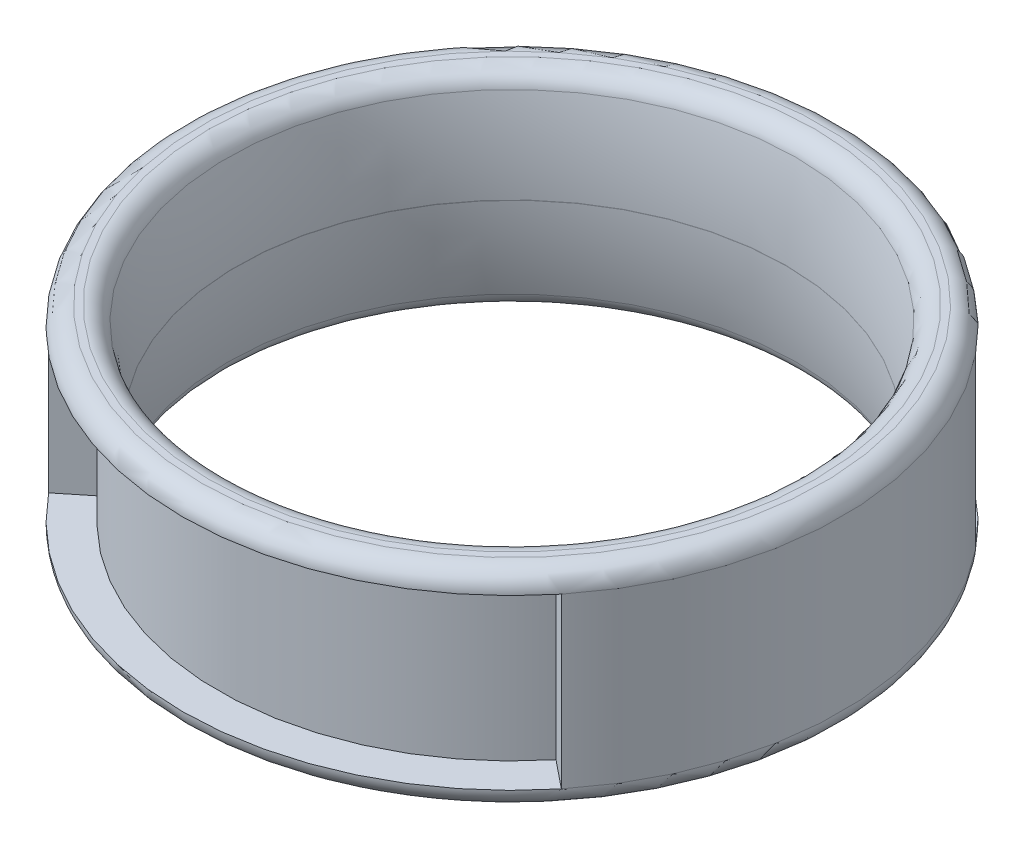
ISO-10303-21;
HEADER;
FILE_DESCRIPTION(('STEP AP214'),'2;1');
FILE_NAME('part.step','',(''),(''),'','','');
FILE_SCHEMA(('AUTOMOTIVE_DESIGN { 1 0 10303 214 1 1 1 1 }'));
ENDSEC;
DATA;
#1=APPLICATION_CONTEXT('core data for automotive mechanical design processes');
#2=APPLICATION_PROTOCOL_DEFINITION('international standard','automotive_design',2000,#1);
#3=PRODUCT_CONTEXT('',#1,'mechanical');
#4=PRODUCT('Part','Part','',(#3));
#5=PRODUCT_RELATED_PRODUCT_CATEGORY('part','',(#4));
#6=PRODUCT_DEFINITION_FORMATION('','',#4);
#7=PRODUCT_DEFINITION_CONTEXT('part definition',#1,'design');
#8=PRODUCT_DEFINITION('design','',#6,#7);
#9=PRODUCT_DEFINITION_SHAPE('','',#8);
#10=(LENGTH_UNIT() NAMED_UNIT(*) SI_UNIT(.MILLI.,.METRE.));
#11=(NAMED_UNIT(*) PLANE_ANGLE_UNIT() SI_UNIT($,.RADIAN.));
#12=(NAMED_UNIT(*) SI_UNIT($,.STERADIAN.) SOLID_ANGLE_UNIT());
#13=UNCERTAINTY_MEASURE_WITH_UNIT(LENGTH_MEASURE(1.E-05),#10,'distance_accuracy_value','');
#14=(GEOMETRIC_REPRESENTATION_CONTEXT(3) GLOBAL_UNCERTAINTY_ASSIGNED_CONTEXT((#13)) GLOBAL_UNIT_ASSIGNED_CONTEXT((#10,
#11,#12)) REPRESENTATION_CONTEXT('',''));
#15=CARTESIAN_POINT('',(0.,0.,0.));
#16=DIRECTION('',(0.,0.,1.));
#17=DIRECTION('',(1.,0.,0.));
#18=AXIS2_PLACEMENT_3D('',#15,#16,#17);
#19=CARTESIAN_POINT('',(0.,-3.75,0.));
#20=DIRECTION('',(0.,1.,0.));
#21=DIRECTION('',(0.,0.,1.));
#22=AXIS2_PLACEMENT_3D('',#19,#20,#21);
#23=CYLINDRICAL_SURFACE('',#22,11.92);
#24=CARTESIAN_POINT('',(0.,-3.05,0.));
#25=DIRECTION('',(0.,1.,0.));
#26=DIRECTION('',(0.,0.,1.));
#27=AXIS2_PLACEMENT_3D('',#24,#25,#26);
#28=CIRCLE('',#27,11.92);
#29=CARTESIAN_POINT('',(-9.27404489584876,-3.05,-7.48855735571155));
#30=VERTEX_POINT('',#29);
#31=CARTESIAN_POINT('',(-9.27404489584876,-3.05,7.48855735571155));
#32=VERTEX_POINT('',#31);
#33=EDGE_CURVE('E167',#30,#32,#28,.T.);
#34=ORIENTED_EDGE('',*,*,#33,.T.);
#35=DIRECTION('',(0.,1.,0.));
#36=VECTOR('',#35,1.);
#37=CARTESIAN_POINT('',(-9.27404489584876,3.05,7.48855735571155));
#38=LINE('',#37,#36);
#39=CARTESIAN_POINT('',(-9.27404489584876,3.05,7.48855735571155));
#40=VERTEX_POINT('',#39);
#41=EDGE_CURVE('E234',#32,#40,#38,.T.);
#42=ORIENTED_EDGE('',*,*,#41,.T.);
#43=CARTESIAN_POINT('',(0.,3.05,0.));
#44=DIRECTION('',(0.,1.,0.));
#45=DIRECTION('',(0.,0.,1.));
#46=AXIS2_PLACEMENT_3D('',#43,#44,#45);
#47=CIRCLE('',#46,11.92);
#48=CARTESIAN_POINT('',(-9.27404489584876,3.05,-7.48855735571155));
#49=VERTEX_POINT('',#48);
#50=EDGE_CURVE('E57',#40,#49,#47,.F.);
#51=ORIENTED_EDGE('',*,*,#50,.T.);
#52=DIRECTION('',(0.,1.,0.));
#53=VECTOR('',#52,1.);
#54=CARTESIAN_POINT('',(-9.27404489584876,3.05,-7.48855735571155));
#55=LINE('',#54,#53);
#56=EDGE_CURVE('E136',#30,#49,#55,.T.);
#57=ORIENTED_EDGE('',*,*,#56,.F.);
#58=EDGE_LOOP('',(#34,#42,#51,#57));
#59=FACE_BOUND('',#58,.T.);
#60=ADVANCED_FACE('F34',(#59),#23,.T.);
#61=CARTESIAN_POINT('',(0.,-3.75,0.));
#62=DIRECTION('',(0.,1.,0.));
#63=DIRECTION('',(0.,0.,1.));
#64=AXIS2_PLACEMENT_3D('',#61,#62,#63);
#65=CYLINDRICAL_SURFACE('',#64,9.92);
#66=CARTESIAN_POINT('',(0.,0.0049999999999998,0.));
#67=DIRECTION('',(0.,-1.,0.));
#68=DIRECTION('',(0.,0.,-1.));
#69=AXIS2_PLACEMENT_3D('',#66,#67,#68);
#70=CIRCLE('',#69,9.92);
#71=CARTESIAN_POINT('',(0.,0.0049999999999998,-9.92));
#72=VERTEX_POINT('',#71);
#73=EDGE_CURVE('E157',#72,#72,#70,.T.);
#74=ORIENTED_EDGE('',*,*,#73,.F.);
#75=EDGE_LOOP('',(#74));
#76=FACE_BOUND('',#75,.T.);
#77=CARTESIAN_POINT('',(0.,-0.00500000000000062,0.));
#78=DIRECTION('',(0.,-1.,0.));
#79=DIRECTION('',(0.,0.,-1.));
#80=AXIS2_PLACEMENT_3D('',#77,#78,#79);
#81=CIRCLE('',#80,9.92);
#82=CARTESIAN_POINT('',(0.,-0.00500000000000062,-9.92));
#83=VERTEX_POINT('',#82);
#84=EDGE_CURVE('E154',#83,#83,#81,.T.);
#85=ORIENTED_EDGE('',*,*,#84,.T.);
#86=EDGE_LOOP('',(#85));
#87=FACE_BOUND('',#86,.T.);
#88=ADVANCED_FACE('F199',(#76,#87),#65,.F.);
#89=CARTESIAN_POINT('',(0.,-3.75,0.));
#90=DIRECTION('',(0.,1.,0.));
#91=DIRECTION('',(0.,0.,1.));
#92=AXIS2_PLACEMENT_3D('',#89,#90,#91);
#93=PLANE('',#92);
#94=CARTESIAN_POINT('',(0.,-3.75,0.));
#95=DIRECTION('',(0.,1.,0.));
#96=DIRECTION('',(0.,0.,1.));
#97=AXIS2_PLACEMENT_3D('',#94,#95,#96);
#98=CIRCLE('',#97,10.9690821675976);
#99=CARTESIAN_POINT('',(0.,-3.75,10.9690821675976));
#100=VERTEX_POINT('',#99);
#101=EDGE_CURVE('E176',#100,#100,#98,.T.);
#102=ORIENTED_EDGE('',*,*,#101,.T.);
#103=EDGE_LOOP('',(#102));
#104=FACE_BOUND('',#103,.T.);
#105=CARTESIAN_POINT('',(0.,-3.75,0.));
#106=DIRECTION('',(0.,1.,0.));
#107=DIRECTION('',(0.,0.,1.));
#108=AXIS2_PLACEMENT_3D('',#105,#106,#107);
#109=CIRCLE('',#108,11.22);
#110=CARTESIAN_POINT('',(0.,-3.75,11.22));
#111=VERTEX_POINT('',#110);
#112=EDGE_CURVE('E166',#111,#111,#109,.F.);
#113=ORIENTED_EDGE('',*,*,#112,.T.);
#114=EDGE_LOOP('',(#113));
#115=FACE_BOUND('',#114,.T.);
#116=ADVANCED_FACE('F205',(#104,#115),#93,.F.);
#117=CARTESIAN_POINT('',(0.,3.75,0.));
#118=DIRECTION('',(0.,1.,0.));
#119=DIRECTION('',(0.,0.,1.));
#120=AXIS2_PLACEMENT_3D('',#117,#118,#119);
#121=PLANE('',#120);
#122=CARTESIAN_POINT('',(0.,3.75,0.));
#123=DIRECTION('',(0.,1.,0.));
#124=DIRECTION('',(0.,0.,1.));
#125=AXIS2_PLACEMENT_3D('',#122,#123,#124);
#126=CIRCLE('',#125,10.9690821675976);
#127=CARTESIAN_POINT('',(0.,3.75,10.9690821675976));
#128=VERTEX_POINT('',#127);
#129=EDGE_CURVE('E42',#128,#128,#126,.F.);
#130=ORIENTED_EDGE('',*,*,#129,.T.);
#131=EDGE_LOOP('',(#130));
#132=FACE_BOUND('',#131,.T.);
#133=CARTESIAN_POINT('',(0.,3.75,0.));
#134=DIRECTION('',(0.,1.,0.));
#135=DIRECTION('',(0.,0.,1.));
#136=AXIS2_PLACEMENT_3D('',#133,#134,#135);
#137=CIRCLE('',#136,11.22);
#138=CARTESIAN_POINT('',(0.,3.75,11.22));
#139=VERTEX_POINT('',#138);
#140=EDGE_CURVE('E170',#139,#139,#137,.T.);
#141=ORIENTED_EDGE('',*,*,#140,.T.);
#142=EDGE_LOOP('',(#141));
#143=FACE_BOUND('',#142,.T.);
#144=ADVANCED_FACE('F181',(#132,#143),#121,.T.);
#145=DIRECTION('',(0.,1.,0.));
#146=VECTOR('',#145,1.);
#147=CARTESIAN_POINT('',(9.27404489584876,3.05,7.48855735571156));
#148=LINE('',#147,#146);
#149=CARTESIAN_POINT('',(9.27404489584876,-3.05,7.48855735571156));
#150=VERTEX_POINT('',#149);
#151=CARTESIAN_POINT('',(9.27404489584876,3.05,7.48855735571155));
#152=VERTEX_POINT('',#151);
#153=EDGE_CURVE('E223',#150,#152,#148,.T.);
#154=ORIENTED_EDGE('',*,*,#153,.F.);
#155=CARTESIAN_POINT('',(9.27404489584876,-3.05,-7.48855735571156));
#156=VERTEX_POINT('',#155);
#157=EDGE_CURVE('E162',#150,#156,#28,.T.);
#158=ORIENTED_EDGE('',*,*,#157,.T.);
#159=DIRECTION('',(0.,1.,0.));
#160=VECTOR('',#159,1.);
#161=CARTESIAN_POINT('',(9.27404489584876,3.05,-7.48855735571156));
#162=LINE('',#161,#160);
#163=CARTESIAN_POINT('',(9.27404489584876,3.05,-7.48855735571156));
#164=VERTEX_POINT('',#163);
#165=EDGE_CURVE('E147',#156,#164,#162,.T.);
#166=ORIENTED_EDGE('',*,*,#165,.T.);
#167=EDGE_CURVE('E163',#164,#152,#47,.F.);
#168=ORIENTED_EDGE('',*,*,#167,.T.);
#169=EDGE_LOOP('',(#154,#158,#166,#168));
#170=FACE_BOUND('',#169,.T.);
#171=ADVANCED_FACE('F201',(#170),#23,.T.);
#172=CARTESIAN_POINT('',(0.,-3.05,0.));
#173=DIRECTION('',(0.,1.,0.));
#174=DIRECTION('',(0.,0.,1.));
#175=AXIS2_PLACEMENT_3D('',#172,#173,#174);
#176=TOROIDAL_SURFACE('',#175,11.22,0.7);
#177=ORIENTED_EDGE('',*,*,#112,.F.);
#178=EDGE_LOOP('',(#177));
#179=FACE_BOUND('',#178,.T.);
#180=EDGE_CURVE('E164',#156,#30,#28,.T.);
#181=ORIENTED_EDGE('',*,*,#180,.F.);
#182=ORIENTED_EDGE('',*,*,#157,.F.);
#183=CARTESIAN_POINT('',(0.,-3.05,0.));
#184=DIRECTION('',(0.,-1.,0.));
#185=DIRECTION('',(0.,0.,-1.));
#186=AXIS2_PLACEMENT_3D('',#183,#184,#185);
#187=CIRCLE('',#186,11.92);
#188=EDGE_CURVE('E127',#150,#32,#187,.T.);
#189=ORIENTED_EDGE('',*,*,#188,.T.);
#190=ORIENTED_EDGE('',*,*,#33,.F.);
#191=EDGE_LOOP('',(#181,#182,#189,#190));
#192=FACE_BOUND('',#191,.T.);
#193=ADVANCED_FACE('F212',(#179,#192),#176,.T.);
#194=CARTESIAN_POINT('',(0.,3.05,0.));
#195=DIRECTION('',(0.,1.,0.));
#196=DIRECTION('',(0.,0.,1.));
#197=AXIS2_PLACEMENT_3D('',#194,#195,#196);
#198=TOROIDAL_SURFACE('',#197,11.22,0.7);
#199=EDGE_CURVE('E160',#49,#164,#47,.F.);
#200=ORIENTED_EDGE('',*,*,#199,.F.);
#201=ORIENTED_EDGE('',*,*,#50,.F.);
#202=CARTESIAN_POINT('',(0.,3.05,0.));
#203=DIRECTION('',(0.,-1.,0.));
#204=DIRECTION('',(0.,0.,-1.));
#205=AXIS2_PLACEMENT_3D('',#202,#203,#204);
#206=CIRCLE('',#205,11.92);
#207=EDGE_CURVE('E116',#152,#40,#206,.T.);
#208=ORIENTED_EDGE('',*,*,#207,.F.);
#209=ORIENTED_EDGE('',*,*,#167,.F.);
#210=EDGE_LOOP('',(#200,#201,#208,#209));
#211=FACE_BOUND('',#210,.T.);
#212=ORIENTED_EDGE('',*,*,#140,.F.);
#213=EDGE_LOOP('',(#212));
#214=FACE_BOUND('',#213,.T.);
#215=ADVANCED_FACE('F218',(#211,#214),#198,.T.);
#216=CARTESIAN_POINT('',(0.,-0.0917507307465195,0.));
#217=DIRECTION('',(0.,-1.,0.));
#218=DIRECTION('',(0.,0.,-1.));
#219=AXIS2_PLACEMENT_3D('',#216,#217,#218);
#220=TOROIDAL_SURFACE('',#219,24.9196879732913,15.);
#221=CARTESIAN_POINT('',(0.,3.20379199381277,0.));
#222=DIRECTION('',(0.,-1.,0.));
#223=DIRECTION('',(0.,0.,-1.));
#224=AXIS2_PLACEMENT_3D('',#221,#222,#223);
#225=CIRCLE('',#224,10.2861853799063);
#226=CARTESIAN_POINT('',(0.,3.20379199381277,-10.2861853799063));
#227=VERTEX_POINT('',#226);
#228=EDGE_CURVE('E11',#227,#227,#225,.F.);
#229=ORIENTED_EDGE('',*,*,#228,.T.);
#230=EDGE_LOOP('',(#229));
#231=FACE_BOUND('',#230,.T.);
#232=ORIENTED_EDGE('',*,*,#73,.T.);
#233=EDGE_LOOP('',(#232));
#234=FACE_BOUND('',#233,.T.);
#235=ADVANCED_FACE('F281',(#231,#234),#220,.T.);
#236=CARTESIAN_POINT('',(0.,0.0917507307465157,0.));
#237=DIRECTION('',(0.,-1.,0.));
#238=DIRECTION('',(0.,0.,-1.));
#239=AXIS2_PLACEMENT_3D('',#236,#237,#238);
#240=TOROIDAL_SURFACE('',#239,24.9196879732913,15.);
#241=CARTESIAN_POINT('',(0.,-3.20379199381277,0.));
#242=DIRECTION('',(0.,1.,0.));
#243=DIRECTION('',(0.,0.,1.));
#244=AXIS2_PLACEMENT_3D('',#241,#242,#243);
#245=CIRCLE('',#244,10.2861853799063);
#246=CARTESIAN_POINT('',(0.,-3.20379199381277,10.2861853799063));
#247=VERTEX_POINT('',#246);
#248=EDGE_CURVE('E173',#247,#247,#245,.F.);
#249=ORIENTED_EDGE('',*,*,#248,.T.);
#250=EDGE_LOOP('',(#249));
#251=FACE_BOUND('',#250,.T.);
#252=ORIENTED_EDGE('',*,*,#84,.F.);
#253=EDGE_LOOP('',(#252));
#254=FACE_BOUND('',#253,.T.);
#255=ADVANCED_FACE('F195',(#251,#254),#240,.T.);
#256=CARTESIAN_POINT('',(0.,-3.05,0.));
#257=DIRECTION('',(0.,-1.,0.));
#258=DIRECTION('',(0.,0.,-1.));
#259=AXIS2_PLACEMENT_3D('',#256,#257,#258);
#260=TOROIDAL_SURFACE('',#259,10.9690821675976,0.7);
#261=ORIENTED_EDGE('',*,*,#101,.F.);
#262=EDGE_LOOP('',(#261));
#263=FACE_BOUND('',#262,.T.);
#264=ORIENTED_EDGE('',*,*,#248,.F.);
#265=EDGE_LOOP('',(#264));
#266=FACE_BOUND('',#265,.T.);
#267=ADVANCED_FACE('F186',(#263,#266),#260,.T.);
#268=CARTESIAN_POINT('',(0.,3.05,0.));
#269=DIRECTION('',(0.,-1.,0.));
#270=DIRECTION('',(0.,0.,-1.));
#271=AXIS2_PLACEMENT_3D('',#268,#269,#270);
#272=TOROIDAL_SURFACE('',#271,10.9690821675976,0.7);
#273=ORIENTED_EDGE('',*,*,#228,.F.);
#274=EDGE_LOOP('',(#273));
#275=FACE_BOUND('',#274,.T.);
#276=ORIENTED_EDGE('',*,*,#129,.F.);
#277=EDGE_LOOP('',(#276));
#278=FACE_BOUND('',#277,.T.);
#279=ADVANCED_FACE('F36',(#275,#278),#272,.T.);
#280=CARTESIAN_POINT('',(9.27404489584876,3.05,-7.48855735571156));
#281=DIRECTION('',(0.,-1.,0.));
#282=DIRECTION('',(0.,0.,-1.));
#283=AXIS2_PLACEMENT_3D('',#280,#281,#282);
#284=PLANE('',#283);
#285=CARTESIAN_POINT('',(0.,3.05,0.));
#286=DIRECTION('',(0.,1.,0.));
#287=DIRECTION('',(0.,0.,1.));
#288=AXIS2_PLACEMENT_3D('',#285,#286,#287);
#289=CIRCLE('',#288,10.62);
#290=CARTESIAN_POINT('',(8.26261382499277,3.05,-6.6718522749712));
#291=VERTEX_POINT('',#290);
#292=CARTESIAN_POINT('',(-8.26261382499277,3.05,-6.6718522749712));
#293=VERTEX_POINT('',#292);
#294=EDGE_CURVE('E152',#291,#293,#289,.T.);
#295=ORIENTED_EDGE('',*,*,#294,.T.);
#296=DIRECTION('',(0.778023900658453,0.,0.62823467749258));
#297=VECTOR('',#296,1.);
#298=CARTESIAN_POINT('',(-9.27404489584876,3.05,-7.48855735571155));
#299=LINE('',#298,#297);
#300=EDGE_CURVE('E121',#49,#293,#299,.T.);
#301=ORIENTED_EDGE('',*,*,#300,.F.);
#302=ORIENTED_EDGE('',*,*,#199,.T.);
#303=DIRECTION('',(-0.778023900658453,0.,0.62823467749258));
#304=VECTOR('',#303,1.);
#305=CARTESIAN_POINT('',(9.27404489584876,3.05,-7.48855735571156));
#306=LINE('',#305,#304);
#307=EDGE_CURVE('E138',#164,#291,#306,.T.);
#308=ORIENTED_EDGE('',*,*,#307,.T.);
#309=EDGE_LOOP('',(#295,#301,#302,#308));
#310=FACE_BOUND('',#309,.T.);
#311=ADVANCED_FACE('F185',(#310),#284,.T.);
#312=CARTESIAN_POINT('',(0.,0.,0.));
#313=DIRECTION('',(0.,1.,0.));
#314=DIRECTION('',(0.,0.,1.));
#315=AXIS2_PLACEMENT_3D('',#312,#313,#314);
#316=CYLINDRICAL_SURFACE('',#315,10.62);
#317=CARTESIAN_POINT('',(0.,-3.05,0.));
#318=DIRECTION('',(0.,1.,0.));
#319=DIRECTION('',(0.,0.,1.));
#320=AXIS2_PLACEMENT_3D('',#317,#318,#319);
#321=CIRCLE('',#320,10.62);
#322=CARTESIAN_POINT('',(8.26261382499277,-3.05,-6.6718522749712));
#323=VERTEX_POINT('',#322);
#324=CARTESIAN_POINT('',(-8.26261382499277,-3.05,-6.6718522749712));
#325=VERTEX_POINT('',#324);
#326=EDGE_CURVE('E150',#323,#325,#321,.T.);
#327=ORIENTED_EDGE('',*,*,#326,.T.);
#328=DIRECTION('',(0.,-1.,0.));
#329=VECTOR('',#328,1.);
#330=CARTESIAN_POINT('',(-8.26261382499277,3.05,-6.6718522749712));
#331=LINE('',#330,#329);
#332=EDGE_CURVE('E125',#293,#325,#331,.T.);
#333=ORIENTED_EDGE('',*,*,#332,.F.);
#334=ORIENTED_EDGE('',*,*,#294,.F.);
#335=DIRECTION('',(0.,-1.,0.));
#336=VECTOR('',#335,1.);
#337=CARTESIAN_POINT('',(8.26261382499277,3.05,-6.6718522749712));
#338=LINE('',#337,#336);
#339=EDGE_CURVE('E141',#291,#323,#338,.T.);
#340=ORIENTED_EDGE('',*,*,#339,.T.);
#341=EDGE_LOOP('',(#327,#333,#334,#340));
#342=FACE_BOUND('',#341,.T.);
#343=ADVANCED_FACE('F192',(#342),#316,.T.);
#344=CARTESIAN_POINT('',(9.27404489584876,-3.05,-7.48855735571156));
#345=DIRECTION('',(0.,1.,0.));
#346=DIRECTION('',(0.,0.,1.));
#347=AXIS2_PLACEMENT_3D('',#344,#345,#346);
#348=PLANE('',#347);
#349=ORIENTED_EDGE('',*,*,#180,.T.);
#350=DIRECTION('',(-0.778023900658453,0.,-0.62823467749258));
#351=VECTOR('',#350,1.);
#352=CARTESIAN_POINT('',(-9.27404489584876,-3.05,-7.48855735571155));
#353=LINE('',#352,#351);
#354=EDGE_CURVE('E133',#325,#30,#353,.T.);
#355=ORIENTED_EDGE('',*,*,#354,.F.);
#356=ORIENTED_EDGE('',*,*,#326,.F.);
#357=DIRECTION('',(0.778023900658453,0.,-0.62823467749258));
#358=VECTOR('',#357,1.);
#359=CARTESIAN_POINT('',(9.27404489584876,-3.05,-7.48855735571156));
#360=LINE('',#359,#358);
#361=EDGE_CURVE('E144',#323,#156,#360,.T.);
#362=ORIENTED_EDGE('',*,*,#361,.T.);
#363=EDGE_LOOP('',(#349,#355,#356,#362));
#364=FACE_BOUND('',#363,.T.);
#365=ADVANCED_FACE('F270',(#364),#348,.T.);
#366=CARTESIAN_POINT('',(0.,0.,0.));
#367=DIRECTION('',(0.62823467749258,0.,0.778023900658453));
#368=DIRECTION('',(0.778023900658453,0.,-0.62823467749258));
#369=AXIS2_PLACEMENT_3D('',#366,#367,#368);
#370=PLANE('',#369);
#371=ORIENTED_EDGE('',*,*,#307,.F.);
#372=ORIENTED_EDGE('',*,*,#165,.F.);
#373=ORIENTED_EDGE('',*,*,#361,.F.);
#374=ORIENTED_EDGE('',*,*,#339,.F.);
#375=EDGE_LOOP('',(#371,#372,#373,#374));
#376=FACE_BOUND('',#375,.T.);
#377=ADVANCED_FACE('F268',(#376),#370,.F.);
#378=CARTESIAN_POINT('',(0.,0.,0.));
#379=DIRECTION('',(0.62823467749258,0.,-0.778023900658453));
#380=DIRECTION('',(-0.778023900658453,0.,-0.62823467749258));
#381=AXIS2_PLACEMENT_3D('',#378,#379,#380);
#382=PLANE('',#381);
#383=ORIENTED_EDGE('',*,*,#300,.T.);
#384=ORIENTED_EDGE('',*,*,#332,.T.);
#385=ORIENTED_EDGE('',*,*,#354,.T.);
#386=ORIENTED_EDGE('',*,*,#56,.T.);
#387=EDGE_LOOP('',(#383,#384,#385,#386));
#388=FACE_BOUND('',#387,.T.);
#389=ADVANCED_FACE('F237',(#388),#382,.T.);
#390=CARTESIAN_POINT('',(9.27404489584876,3.05,7.48855735571156));
#391=DIRECTION('',(0.,-1.,0.));
#392=DIRECTION('',(0.,0.,1.));
#393=AXIS2_PLACEMENT_3D('',#390,#391,#392);
#394=PLANE('',#393);
#395=CARTESIAN_POINT('',(0.,3.05,0.));
#396=DIRECTION('',(0.,-1.,0.));
#397=DIRECTION('',(0.,0.,-1.));
#398=AXIS2_PLACEMENT_3D('',#395,#396,#397);
#399=CIRCLE('',#398,10.62);
#400=CARTESIAN_POINT('',(8.26261382499277,3.05,6.6718522749712));
#401=VERTEX_POINT('',#400);
#402=CARTESIAN_POINT('',(-8.26261382499277,3.05,6.6718522749712));
#403=VERTEX_POINT('',#402);
#404=EDGE_CURVE('E114',#401,#403,#399,.T.);
#405=ORIENTED_EDGE('',*,*,#404,.F.);
#406=DIRECTION('',(-0.778023900658453,0.,-0.62823467749258));
#407=VECTOR('',#406,1.);
#408=CARTESIAN_POINT('',(9.27404489584876,3.05,7.48855735571156));
#409=LINE('',#408,#407);
#410=EDGE_CURVE('E49',#152,#401,#409,.T.);
#411=ORIENTED_EDGE('',*,*,#410,.F.);
#412=ORIENTED_EDGE('',*,*,#207,.T.);
#413=DIRECTION('',(0.778023900658453,0.,-0.62823467749258));
#414=VECTOR('',#413,1.);
#415=CARTESIAN_POINT('',(-9.27404489584876,3.05,7.48855735571155));
#416=LINE('',#415,#414);
#417=EDGE_CURVE('E105',#40,#403,#416,.T.);
#418=ORIENTED_EDGE('',*,*,#417,.T.);
#419=EDGE_LOOP('',(#405,#411,#412,#418));
#420=FACE_BOUND('',#419,.T.);
#421=ADVANCED_FACE('F113',(#420),#394,.T.);
#422=CARTESIAN_POINT('',(0.,0.,0.));
#423=DIRECTION('',(0.,1.,0.));
#424=DIRECTION('',(0.,0.,-1.));
#425=AXIS2_PLACEMENT_3D('',#422,#423,#424);
#426=CYLINDRICAL_SURFACE('',#425,10.62);
#427=CARTESIAN_POINT('',(0.,-3.05,0.));
#428=DIRECTION('',(0.,-1.,0.));
#429=DIRECTION('',(0.,0.,-1.));
#430=AXIS2_PLACEMENT_3D('',#427,#428,#429);
#431=CIRCLE('',#430,10.62);
#432=CARTESIAN_POINT('',(8.26261382499277,-3.05,6.6718522749712));
#433=VERTEX_POINT('',#432);
#434=CARTESIAN_POINT('',(-8.26261382499277,-3.05,6.6718522749712));
#435=VERTEX_POINT('',#434);
#436=EDGE_CURVE('E122',#433,#435,#431,.T.);
#437=ORIENTED_EDGE('',*,*,#436,.F.);
#438=DIRECTION('',(0.,-1.,0.));
#439=VECTOR('',#438,1.);
#440=CARTESIAN_POINT('',(8.26261382499277,3.05,6.6718522749712));
#441=LINE('',#440,#439);
#442=EDGE_CURVE('E120',#401,#433,#441,.T.);
#443=ORIENTED_EDGE('',*,*,#442,.F.);
#444=ORIENTED_EDGE('',*,*,#404,.T.);
#445=DIRECTION('',(0.,-1.,0.));
#446=VECTOR('',#445,1.);
#447=CARTESIAN_POINT('',(-8.26261382499277,3.05,6.6718522749712));
#448=LINE('',#447,#446);
#449=EDGE_CURVE('E102',#403,#435,#448,.T.);
#450=ORIENTED_EDGE('',*,*,#449,.T.);
#451=EDGE_LOOP('',(#437,#443,#444,#450));
#452=FACE_BOUND('',#451,.T.);
#453=ADVANCED_FACE('F118',(#452),#426,.T.);
#454=CARTESIAN_POINT('',(9.27404489584876,-3.05,7.48855735571156));
#455=DIRECTION('',(0.,1.,0.));
#456=DIRECTION('',(0.,0.,-1.));
#457=AXIS2_PLACEMENT_3D('',#454,#455,#456);
#458=PLANE('',#457);
#459=ORIENTED_EDGE('',*,*,#188,.F.);
#460=DIRECTION('',(0.778023900658453,0.,0.62823467749258));
#461=VECTOR('',#460,1.);
#462=CARTESIAN_POINT('',(9.27404489584876,-3.05,7.48855735571156));
#463=LINE('',#462,#461);
#464=EDGE_CURVE('E227',#433,#150,#463,.T.);
#465=ORIENTED_EDGE('',*,*,#464,.F.);
#466=ORIENTED_EDGE('',*,*,#436,.T.);
#467=DIRECTION('',(-0.778023900658453,0.,0.62823467749258));
#468=VECTOR('',#467,1.);
#469=CARTESIAN_POINT('',(-9.27404489584876,-3.05,7.48855735571155));
#470=LINE('',#469,#468);
#471=EDGE_CURVE('E107',#435,#32,#470,.T.);
#472=ORIENTED_EDGE('',*,*,#471,.T.);
#473=EDGE_LOOP('',(#459,#465,#466,#472));
#474=FACE_BOUND('',#473,.T.);
#475=ADVANCED_FACE('F251',(#474),#458,.T.);
#476=CARTESIAN_POINT('',(0.,0.,0.));
#477=DIRECTION('',(0.62823467749258,0.,-0.778023900658453));
#478=DIRECTION('',(0.778023900658453,0.,0.62823467749258));
#479=AXIS2_PLACEMENT_3D('',#476,#477,#478);
#480=PLANE('',#479);
#481=ORIENTED_EDGE('',*,*,#410,.T.);
#482=ORIENTED_EDGE('',*,*,#442,.T.);
#483=ORIENTED_EDGE('',*,*,#464,.T.);
#484=ORIENTED_EDGE('',*,*,#153,.T.);
#485=EDGE_LOOP('',(#481,#482,#483,#484));
#486=FACE_BOUND('',#485,.T.);
#487=ADVANCED_FACE('F252',(#486),#480,.F.);
#488=CARTESIAN_POINT('',(0.,0.,0.));
#489=DIRECTION('',(0.62823467749258,0.,0.778023900658453));
#490=DIRECTION('',(-0.778023900658453,0.,0.62823467749258));
#491=AXIS2_PLACEMENT_3D('',#488,#489,#490);
#492=PLANE('',#491);
#493=ORIENTED_EDGE('',*,*,#417,.F.);
#494=ORIENTED_EDGE('',*,*,#41,.F.);
#495=ORIENTED_EDGE('',*,*,#471,.F.);
#496=ORIENTED_EDGE('',*,*,#449,.F.);
#497=EDGE_LOOP('',(#493,#494,#495,#496));
#498=FACE_BOUND('',#497,.T.);
#499=ADVANCED_FACE('F104',(#498),#492,.T.);
#500=CLOSED_SHELL('',(#60,#88,#116,#144,#171,#193,#215,#235,#255,#267,#279,#311,#343,#365,#377,
#389,#421,#453,#475,#487,#499));
#501=MANIFOLD_SOLID_BREP('B2',#500);
#502=ADVANCED_BREP_SHAPE_REPRESENTATION('',(#18,#501),#14);
#503=SHAPE_DEFINITION_REPRESENTATION(#9,#502);
ENDSEC;
END-ISO-10303-21;
